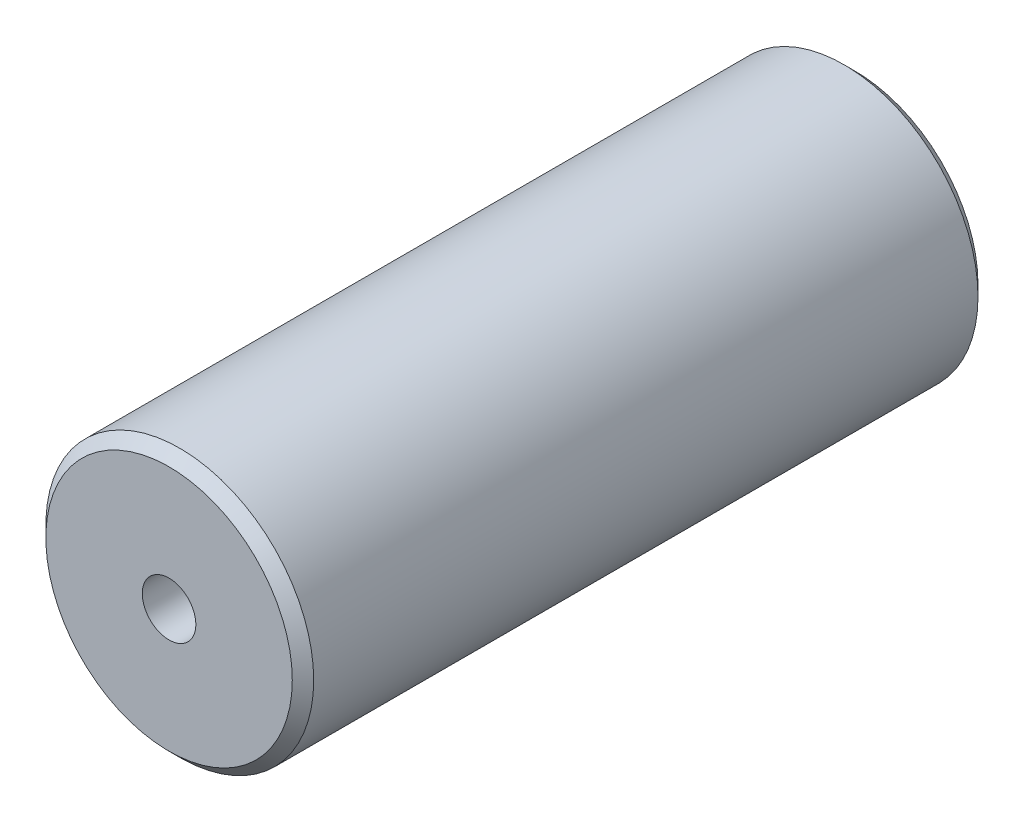
ISO-10303-21;
HEADER;
FILE_DESCRIPTION(('STEP AP214'),'2;1');
FILE_NAME('part.step','',(''),(''),'','','');
FILE_SCHEMA(('AUTOMOTIVE_DESIGN { 1 0 10303 214 1 1 1 1 }'));
ENDSEC;
DATA;
#1=APPLICATION_CONTEXT('core data for automotive mechanical design processes');
#2=APPLICATION_PROTOCOL_DEFINITION('international standard','automotive_design',2000,#1);
#3=PRODUCT_CONTEXT('',#1,'mechanical');
#4=PRODUCT('Part','Part','',(#3));
#5=PRODUCT_RELATED_PRODUCT_CATEGORY('part','',(#4));
#6=PRODUCT_DEFINITION_FORMATION('','',#4);
#7=PRODUCT_DEFINITION_CONTEXT('part definition',#1,'design');
#8=PRODUCT_DEFINITION('design','',#6,#7);
#9=PRODUCT_DEFINITION_SHAPE('','',#8);
#10=(LENGTH_UNIT() NAMED_UNIT(*) SI_UNIT(.MILLI.,.METRE.));
#11=(NAMED_UNIT(*) PLANE_ANGLE_UNIT() SI_UNIT($,.RADIAN.));
#12=(NAMED_UNIT(*) SI_UNIT($,.STERADIAN.) SOLID_ANGLE_UNIT());
#13=UNCERTAINTY_MEASURE_WITH_UNIT(LENGTH_MEASURE(1.E-05),#10,'distance_accuracy_value','');
#14=(GEOMETRIC_REPRESENTATION_CONTEXT(3) GLOBAL_UNCERTAINTY_ASSIGNED_CONTEXT((#13)) GLOBAL_UNIT_ASSIGNED_CONTEXT((#10,
#11,#12)) REPRESENTATION_CONTEXT('',''));
#15=CARTESIAN_POINT('',(0.,0.,0.));
#16=DIRECTION('',(0.,0.,1.));
#17=DIRECTION('',(1.,0.,0.));
#18=AXIS2_PLACEMENT_3D('',#15,#16,#17);
#19=CARTESIAN_POINT('',(0.,0.,32.));
#20=DIRECTION('',(0.,0.,-1.));
#21=DIRECTION('',(-1.,0.,0.));
#22=AXIS2_PLACEMENT_3D('',#19,#20,#21);
#23=CYLINDRICAL_SURFACE('',#22,12.5);
#24=CARTESIAN_POINT('',(0.,0.,-31.));
#25=DIRECTION('',(0.,0.,1.));
#26=DIRECTION('',(1.,0.,0.));
#27=AXIS2_PLACEMENT_3D('',#24,#25,#26);
#28=CIRCLE('',#27,12.5);
#29=CARTESIAN_POINT('',(12.5,0.,-31.));
#30=VERTEX_POINT('',#29);
#31=EDGE_CURVE('E84',#30,#30,#28,.T.);
#32=ORIENTED_EDGE('',*,*,#31,.T.);
#33=EDGE_LOOP('',(#32));
#34=FACE_BOUND('',#33,.T.);
#35=CARTESIAN_POINT('',(0.,0.,31.));
#36=DIRECTION('',(0.,0.,1.));
#37=DIRECTION('',(1.,0.,0.));
#38=AXIS2_PLACEMENT_3D('',#35,#36,#37);
#39=CIRCLE('',#38,12.5);
#40=CARTESIAN_POINT('',(12.5,0.,31.));
#41=VERTEX_POINT('',#40);
#42=EDGE_CURVE('E81',#41,#41,#39,.F.);
#43=ORIENTED_EDGE('',*,*,#42,.T.);
#44=EDGE_LOOP('',(#43));
#45=FACE_BOUND('',#44,.T.);
#46=ADVANCED_FACE('F45',(#34,#45),#23,.T.);
#47=CARTESIAN_POINT('',(0.,0.,32.));
#48=DIRECTION('',(0.,0.,1.));
#49=DIRECTION('',(1.,0.,0.));
#50=AXIS2_PLACEMENT_3D('',#47,#48,#49);
#51=PLANE('',#50);
#52=CARTESIAN_POINT('',(0.,0.,32.));
#53=DIRECTION('',(0.,0.,1.));
#54=DIRECTION('',(1.,0.,0.));
#55=AXIS2_PLACEMENT_3D('',#52,#53,#54);
#56=CIRCLE('',#55,2.49999999999999);
#57=CARTESIAN_POINT('',(2.49999999999999,0.,32.));
#58=VERTEX_POINT('',#57);
#59=EDGE_CURVE('E70',#58,#58,#56,.T.);
#60=ORIENTED_EDGE('',*,*,#59,.F.);
#61=EDGE_LOOP('',(#60));
#62=FACE_BOUND('',#61,.T.);
#63=CARTESIAN_POINT('',(0.,0.,32.));
#64=DIRECTION('',(0.,0.,1.));
#65=DIRECTION('',(1.,0.,0.));
#66=AXIS2_PLACEMENT_3D('',#63,#64,#65);
#67=CIRCLE('',#66,11.5);
#68=CARTESIAN_POINT('',(11.5,0.,32.));
#69=VERTEX_POINT('',#68);
#70=EDGE_CURVE('E11',#69,#69,#67,.T.);
#71=ORIENTED_EDGE('',*,*,#70,.T.);
#72=EDGE_LOOP('',(#71));
#73=FACE_BOUND('',#72,.T.);
#74=ADVANCED_FACE('F98',(#62,#73),#51,.T.);
#75=CARTESIAN_POINT('',(0.,0.,-32.));
#76=DIRECTION('',(0.,0.,1.));
#77=DIRECTION('',(1.,0.,0.));
#78=AXIS2_PLACEMENT_3D('',#75,#76,#77);
#79=PLANE('',#78);
#80=CARTESIAN_POINT('',(0.,0.,-32.));
#81=DIRECTION('',(0.,0.,-1.));
#82=DIRECTION('',(-1.,0.,0.));
#83=AXIS2_PLACEMENT_3D('',#80,#81,#82);
#84=CIRCLE('',#83,2.49999999999999);
#85=CARTESIAN_POINT('',(-2.49999999999999,0.,-32.));
#86=VERTEX_POINT('',#85);
#87=EDGE_CURVE('E71',#86,#86,#84,.T.);
#88=ORIENTED_EDGE('',*,*,#87,.F.);
#89=EDGE_LOOP('',(#88));
#90=FACE_BOUND('',#89,.T.);
#91=CARTESIAN_POINT('',(0.,0.,-32.));
#92=DIRECTION('',(0.,0.,1.));
#93=DIRECTION('',(1.,0.,0.));
#94=AXIS2_PLACEMENT_3D('',#91,#92,#93);
#95=CIRCLE('',#94,11.5);
#96=CARTESIAN_POINT('',(11.5,0.,-32.));
#97=VERTEX_POINT('',#96);
#98=EDGE_CURVE('E54',#97,#97,#95,.F.);
#99=ORIENTED_EDGE('',*,*,#98,.T.);
#100=EDGE_LOOP('',(#99));
#101=FACE_BOUND('',#100,.T.);
#102=ADVANCED_FACE('F89',(#90,#101),#79,.F.);
#103=CARTESIAN_POINT('',(0.,0.,-31.));
#104=DIRECTION('',(0.,0.,1.));
#105=DIRECTION('',(1.,0.,0.));
#106=AXIS2_PLACEMENT_3D('',#103,#104,#105);
#107=CONICAL_SURFACE('',#106,12.5,0.785398163397458);
#108=ORIENTED_EDGE('',*,*,#98,.F.);
#109=EDGE_LOOP('',(#108));
#110=FACE_BOUND('',#109,.T.);
#111=ORIENTED_EDGE('',*,*,#31,.F.);
#112=EDGE_LOOP('',(#111));
#113=FACE_BOUND('',#112,.T.);
#114=ADVANCED_FACE('F91',(#110,#113),#107,.T.);
#115=CARTESIAN_POINT('',(0.,0.,32.));
#116=DIRECTION('',(0.,0.,-1.));
#117=DIRECTION('',(-1.,0.,0.));
#118=AXIS2_PLACEMENT_3D('',#115,#116,#117);
#119=CONICAL_SURFACE('',#118,11.5,0.785398163397447);
#120=ORIENTED_EDGE('',*,*,#42,.F.);
#121=EDGE_LOOP('',(#120));
#122=FACE_BOUND('',#121,.T.);
#123=ORIENTED_EDGE('',*,*,#70,.F.);
#124=EDGE_LOOP('',(#123));
#125=FACE_BOUND('',#124,.T.);
#126=ADVANCED_FACE('F48',(#122,#125),#119,.T.);
#127=CARTESIAN_POINT('',(0.,0.,17.));
#128=DIRECTION('',(0.,0.,1.));
#129=DIRECTION('',(1.,0.,0.));
#130=AXIS2_PLACEMENT_3D('',#127,#128,#129);
#131=CONICAL_SURFACE('',#130,2.5,1.02974425867665);
#132=CARTESIAN_POINT('',(0.,0.,15.4978484524311));
#133=VERTEX_POINT('',#132);
#134=VERTEX_LOOP('',#133);
#135=FACE_BOUND('',#134,.T.);
#136=CARTESIAN_POINT('',(0.,0.,17.));
#137=DIRECTION('',(0.,0.,1.));
#138=DIRECTION('',(1.,0.,0.));
#139=AXIS2_PLACEMENT_3D('',#136,#137,#138);
#140=CIRCLE('',#139,2.5);
#141=CARTESIAN_POINT('',(2.5,0.,17.));
#142=VERTEX_POINT('',#141);
#143=EDGE_CURVE('E74',#142,#142,#140,.T.);
#144=ORIENTED_EDGE('',*,*,#143,.T.);
#145=EDGE_LOOP('',(#144));
#146=FACE_BOUND('',#145,.T.);
#147=ADVANCED_FACE('F104',(#135,#146),#131,.F.);
#148=CARTESIAN_POINT('',(0.,0.,32.));
#149=DIRECTION('',(0.,0.,1.));
#150=DIRECTION('',(1.,0.,0.));
#151=AXIS2_PLACEMENT_3D('',#148,#149,#150);
#152=CYLINDRICAL_SURFACE('',#151,2.49999999999999);
#153=ORIENTED_EDGE('',*,*,#143,.F.);
#154=EDGE_LOOP('',(#153));
#155=FACE_BOUND('',#154,.T.);
#156=ORIENTED_EDGE('',*,*,#59,.T.);
#157=EDGE_LOOP('',(#156));
#158=FACE_BOUND('',#157,.T.);
#159=ADVANCED_FACE('F64',(#155,#158),#152,.F.);
#160=CARTESIAN_POINT('',(0.,0.,-17.));
#161=DIRECTION('',(0.,0.,-1.));
#162=DIRECTION('',(-1.,0.,0.));
#163=AXIS2_PLACEMENT_3D('',#160,#161,#162);
#164=CONICAL_SURFACE('',#163,2.5,1.02974425867665);
#165=CARTESIAN_POINT('',(0.,0.,-15.4978484524311));
#166=VERTEX_POINT('',#165);
#167=VERTEX_LOOP('',#166);
#168=FACE_BOUND('',#167,.T.);
#169=CARTESIAN_POINT('',(0.,0.,-17.));
#170=DIRECTION('',(0.,0.,-1.));
#171=DIRECTION('',(-1.,0.,0.));
#172=AXIS2_PLACEMENT_3D('',#169,#170,#171);
#173=CIRCLE('',#172,2.5);
#174=CARTESIAN_POINT('',(-2.5,0.,-17.));
#175=VERTEX_POINT('',#174);
#176=EDGE_CURVE('E68',#175,#175,#173,.T.);
#177=ORIENTED_EDGE('',*,*,#176,.T.);
#178=EDGE_LOOP('',(#177));
#179=FACE_BOUND('',#178,.T.);
#180=ADVANCED_FACE('F60',(#168,#179),#164,.F.);
#181=CARTESIAN_POINT('',(0.,0.,-32.));
#182=DIRECTION('',(0.,0.,-1.));
#183=DIRECTION('',(-1.,0.,0.));
#184=AXIS2_PLACEMENT_3D('',#181,#182,#183);
#185=CYLINDRICAL_SURFACE('',#184,2.49999999999999);
#186=ORIENTED_EDGE('',*,*,#176,.F.);
#187=EDGE_LOOP('',(#186));
#188=FACE_BOUND('',#187,.T.);
#189=ORIENTED_EDGE('',*,*,#87,.T.);
#190=EDGE_LOOP('',(#189));
#191=FACE_BOUND('',#190,.T.);
#192=ADVANCED_FACE('F63',(#188,#191),#185,.F.);
#193=CLOSED_SHELL('',(#46,#74,#102,#114,#126,#147,#159,#180,#192));
#194=MANIFOLD_SOLID_BREP('B2',#193);
#195=ADVANCED_BREP_SHAPE_REPRESENTATION('',(#18,#194),#14);
#196=SHAPE_DEFINITION_REPRESENTATION(#9,#195);
ENDSEC;
END-ISO-10303-21;
